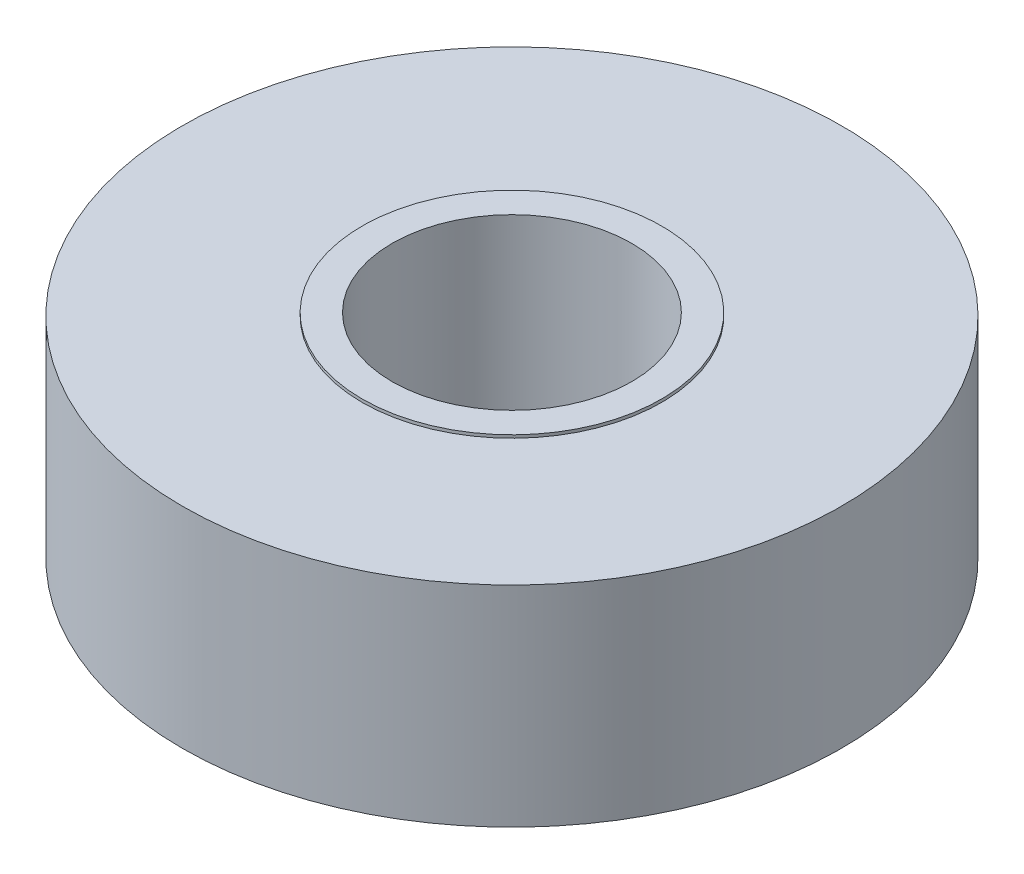
ISO-10303-21;
HEADER;
FILE_DESCRIPTION(('STEP AP214'),'2;1');
FILE_NAME('part.step','',(''),(''),'','','');
FILE_SCHEMA(('AUTOMOTIVE_DESIGN { 1 0 10303 214 1 1 1 1 }'));
ENDSEC;
DATA;
#1=APPLICATION_CONTEXT('core data for automotive mechanical design processes');
#2=APPLICATION_PROTOCOL_DEFINITION('international standard','automotive_design',2000,#1);
#3=PRODUCT_CONTEXT('',#1,'mechanical');
#4=PRODUCT('Part','Part','',(#3));
#5=PRODUCT_RELATED_PRODUCT_CATEGORY('part','',(#4));
#6=PRODUCT_DEFINITION_FORMATION('','',#4);
#7=PRODUCT_DEFINITION_CONTEXT('part definition',#1,'design');
#8=PRODUCT_DEFINITION('design','',#6,#7);
#9=PRODUCT_DEFINITION_SHAPE('','',#8);
#10=(LENGTH_UNIT() NAMED_UNIT(*) SI_UNIT(.MILLI.,.METRE.));
#11=(NAMED_UNIT(*) PLANE_ANGLE_UNIT() SI_UNIT($,.RADIAN.));
#12=(NAMED_UNIT(*) SI_UNIT($,.STERADIAN.) SOLID_ANGLE_UNIT());
#13=UNCERTAINTY_MEASURE_WITH_UNIT(LENGTH_MEASURE(1.E-05),#10,'distance_accuracy_value','');
#14=(GEOMETRIC_REPRESENTATION_CONTEXT(3) GLOBAL_UNCERTAINTY_ASSIGNED_CONTEXT((#13)) GLOBAL_UNIT_ASSIGNED_CONTEXT((#10,
#11,#12)) REPRESENTATION_CONTEXT('',''));
#15=CARTESIAN_POINT('',(0.,0.,0.));
#16=DIRECTION('',(0.,0.,1.));
#17=DIRECTION('',(1.,0.,0.));
#18=AXIS2_PLACEMENT_3D('',#15,#16,#17);
#19=CARTESIAN_POINT('',(0.,3.5,0.));
#20=DIRECTION('',(0.,1.,0.));
#21=DIRECTION('',(0.,0.,1.));
#22=AXIS2_PLACEMENT_3D('',#19,#20,#21);
#23=PLANE('',#22);
#24=CARTESIAN_POINT('',(0.,3.5,0.));
#25=DIRECTION('',(0.,1.,0.));
#26=DIRECTION('',(0.,0.,1.));
#27=AXIS2_PLACEMENT_3D('',#24,#25,#26);
#28=CIRCLE('',#27,11.);
#29=CARTESIAN_POINT('',(0.,3.5,11.));
#30=VERTEX_POINT('',#29);
#31=EDGE_CURVE('E38',#30,#30,#28,.T.);
#32=ORIENTED_EDGE('',*,*,#31,.T.);
#33=EDGE_LOOP('',(#32));
#34=FACE_BOUND('',#33,.T.);
#35=CARTESIAN_POINT('',(0.,3.5,0.));
#36=DIRECTION('',(0.,1.,0.));
#37=DIRECTION('',(0.,0.,1.));
#38=AXIS2_PLACEMENT_3D('',#35,#36,#37);
#39=CIRCLE('',#38,5.);
#40=CARTESIAN_POINT('',(0.,3.5,5.));
#41=VERTEX_POINT('',#40);
#42=EDGE_CURVE('E47',#41,#41,#39,.F.);
#43=ORIENTED_EDGE('',*,*,#42,.T.);
#44=EDGE_LOOP('',(#43));
#45=FACE_BOUND('',#44,.T.);
#46=ADVANCED_FACE('F31',(#34,#45),#23,.T.);
#47=CARTESIAN_POINT('',(0.,-3.5,0.));
#48=DIRECTION('',(0.,1.,0.));
#49=DIRECTION('',(0.,0.,1.));
#50=AXIS2_PLACEMENT_3D('',#47,#48,#49);
#51=PLANE('',#50);
#52=CARTESIAN_POINT('',(0.,-3.5,0.));
#53=DIRECTION('',(0.,1.,0.));
#54=DIRECTION('',(0.,0.,1.));
#55=AXIS2_PLACEMENT_3D('',#52,#53,#54);
#56=CIRCLE('',#55,11.);
#57=CARTESIAN_POINT('',(0.,-3.5,11.));
#58=VERTEX_POINT('',#57);
#59=EDGE_CURVE('E42',#58,#58,#56,.T.);
#60=ORIENTED_EDGE('',*,*,#59,.F.);
#61=EDGE_LOOP('',(#60));
#62=FACE_BOUND('',#61,.T.);
#63=CARTESIAN_POINT('',(0.,-3.5,0.));
#64=DIRECTION('',(0.,1.,0.));
#65=DIRECTION('',(0.,0.,1.));
#66=AXIS2_PLACEMENT_3D('',#63,#64,#65);
#67=CIRCLE('',#66,5.);
#68=CARTESIAN_POINT('',(0.,-3.5,5.));
#69=VERTEX_POINT('',#68);
#70=EDGE_CURVE('E10',#69,#69,#67,.F.);
#71=ORIENTED_EDGE('',*,*,#70,.F.);
#72=EDGE_LOOP('',(#71));
#73=FACE_BOUND('',#72,.T.);
#74=ADVANCED_FACE('F83',(#62,#73),#51,.F.);
#75=CARTESIAN_POINT('',(0.,3.5,0.));
#76=DIRECTION('',(0.,-1.,0.));
#77=DIRECTION('',(0.,0.,-1.));
#78=AXIS2_PLACEMENT_3D('',#75,#76,#77);
#79=CYLINDRICAL_SURFACE('',#78,11.);
#80=ORIENTED_EDGE('',*,*,#31,.F.);
#81=EDGE_LOOP('',(#80));
#82=FACE_BOUND('',#81,.T.);
#83=ORIENTED_EDGE('',*,*,#59,.T.);
#84=EDGE_LOOP('',(#83));
#85=FACE_BOUND('',#84,.T.);
#86=ADVANCED_FACE('F33',(#82,#85),#79,.T.);
#87=CARTESIAN_POINT('',(0.,3.6,0.));
#88=DIRECTION('',(0.,-1.,0.));
#89=DIRECTION('',(0.,0.,-1.));
#90=AXIS2_PLACEMENT_3D('',#87,#88,#89);
#91=CYLINDRICAL_SURFACE('',#90,5.);
#92=CARTESIAN_POINT('',(0.,-3.6,0.));
#93=DIRECTION('',(0.,1.,0.));
#94=DIRECTION('',(0.,0.,1.));
#95=AXIS2_PLACEMENT_3D('',#92,#93,#94);
#96=CIRCLE('',#95,5.);
#97=CARTESIAN_POINT('',(0.,-3.6,5.));
#98=VERTEX_POINT('',#97);
#99=EDGE_CURVE('E52',#98,#98,#96,.T.);
#100=ORIENTED_EDGE('',*,*,#99,.T.);
#101=EDGE_LOOP('',(#100));
#102=FACE_BOUND('',#101,.T.);
#103=ORIENTED_EDGE('',*,*,#70,.T.);
#104=EDGE_LOOP('',(#103));
#105=FACE_BOUND('',#104,.T.);
#106=ADVANCED_FACE('F77',(#102,#105),#91,.T.);
#107=CARTESIAN_POINT('',(0.,-3.6,0.));
#108=DIRECTION('',(0.,1.,0.));
#109=DIRECTION('',(0.,0.,1.));
#110=AXIS2_PLACEMENT_3D('',#107,#108,#109);
#111=PLANE('',#110);
#112=ORIENTED_EDGE('',*,*,#99,.F.);
#113=EDGE_LOOP('',(#112));
#114=FACE_BOUND('',#113,.T.);
#115=CARTESIAN_POINT('',(0.,-3.6,0.));
#116=DIRECTION('',(0.,1.,0.));
#117=DIRECTION('',(0.,0.,1.));
#118=AXIS2_PLACEMENT_3D('',#115,#116,#117);
#119=CIRCLE('',#118,4.);
#120=CARTESIAN_POINT('',(0.,-3.6,4.));
#121=VERTEX_POINT('',#120);
#122=EDGE_CURVE('E58',#121,#121,#119,.T.);
#123=ORIENTED_EDGE('',*,*,#122,.T.);
#124=EDGE_LOOP('',(#123));
#125=FACE_BOUND('',#124,.T.);
#126=ADVANCED_FACE('F78',(#114,#125),#111,.F.);
#127=CARTESIAN_POINT('',(0.,3.5,0.));
#128=DIRECTION('',(0.,-1.,0.));
#129=DIRECTION('',(0.,0.,-1.));
#130=AXIS2_PLACEMENT_3D('',#127,#128,#129);
#131=CYLINDRICAL_SURFACE('',#130,4.);
#132=ORIENTED_EDGE('',*,*,#122,.F.);
#133=EDGE_LOOP('',(#132));
#134=FACE_BOUND('',#133,.T.);
#135=CARTESIAN_POINT('',(0.,3.6,0.));
#136=DIRECTION('',(0.,1.,0.));
#137=DIRECTION('',(0.,0.,1.));
#138=AXIS2_PLACEMENT_3D('',#135,#136,#137);
#139=CIRCLE('',#138,4.);
#140=CARTESIAN_POINT('',(0.,3.6,4.));
#141=VERTEX_POINT('',#140);
#142=EDGE_CURVE('E55',#141,#141,#139,.T.);
#143=ORIENTED_EDGE('',*,*,#142,.T.);
#144=EDGE_LOOP('',(#143));
#145=FACE_BOUND('',#144,.T.);
#146=ADVANCED_FACE('F64',(#134,#145),#131,.F.);
#147=CARTESIAN_POINT('',(0.,3.6,0.));
#148=DIRECTION('',(0.,1.,0.));
#149=DIRECTION('',(0.,0.,1.));
#150=AXIS2_PLACEMENT_3D('',#147,#148,#149);
#151=PLANE('',#150);
#152=CARTESIAN_POINT('',(0.,3.6,0.));
#153=DIRECTION('',(0.,1.,0.));
#154=DIRECTION('',(0.,0.,1.));
#155=AXIS2_PLACEMENT_3D('',#152,#153,#154);
#156=CIRCLE('',#155,5.);
#157=CARTESIAN_POINT('',(0.,3.6,5.));
#158=VERTEX_POINT('',#157);
#159=EDGE_CURVE('E51',#158,#158,#156,.T.);
#160=ORIENTED_EDGE('',*,*,#159,.T.);
#161=EDGE_LOOP('',(#160));
#162=FACE_BOUND('',#161,.T.);
#163=ORIENTED_EDGE('',*,*,#142,.F.);
#164=EDGE_LOOP('',(#163));
#165=FACE_BOUND('',#164,.T.);
#166=ADVANCED_FACE('F66',(#162,#165),#151,.T.);
#167=ORIENTED_EDGE('',*,*,#42,.F.);
#168=EDGE_LOOP('',(#167));
#169=FACE_BOUND('',#168,.T.);
#170=ORIENTED_EDGE('',*,*,#159,.F.);
#171=EDGE_LOOP('',(#170));
#172=FACE_BOUND('',#171,.T.);
#173=ADVANCED_FACE('F68',(#169,#172),#91,.T.);
#174=CLOSED_SHELL('',(#46,#74,#86,#106,#126,#146,#166,#173));
#175=MANIFOLD_SOLID_BREP('B2',#174);
#176=ADVANCED_BREP_SHAPE_REPRESENTATION('',(#18,#175),#14);
#177=SHAPE_DEFINITION_REPRESENTATION(#9,#176);
ENDSEC;
END-ISO-10303-21;
